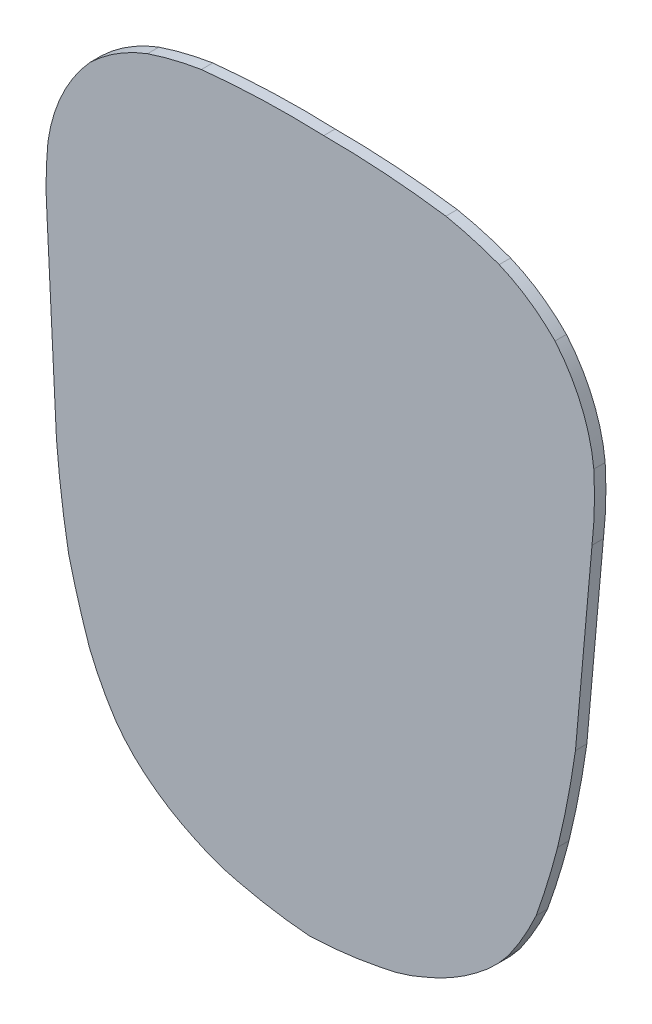
ISO-10303-21;
HEADER;
FILE_DESCRIPTION(('STEP AP214'),'2;1');
FILE_NAME('part.step','',(''),(''),'','','');
FILE_SCHEMA(('AUTOMOTIVE_DESIGN { 1 0 10303 214 1 1 1 1 }'));
ENDSEC;
DATA;
#1=APPLICATION_CONTEXT('core data for automotive mechanical design processes');
#2=APPLICATION_PROTOCOL_DEFINITION('international standard','automotive_design',2000,#1);
#3=PRODUCT_CONTEXT('',#1,'mechanical');
#4=PRODUCT('Part','Part','',(#3));
#5=PRODUCT_RELATED_PRODUCT_CATEGORY('part','',(#4));
#6=PRODUCT_DEFINITION_FORMATION('','',#4);
#7=PRODUCT_DEFINITION_CONTEXT('part definition',#1,'design');
#8=PRODUCT_DEFINITION('design','',#6,#7);
#9=PRODUCT_DEFINITION_SHAPE('','',#8);
#10=(LENGTH_UNIT() NAMED_UNIT(*) SI_UNIT(.MILLI.,.METRE.));
#11=(NAMED_UNIT(*) PLANE_ANGLE_UNIT() SI_UNIT($,.RADIAN.));
#12=(NAMED_UNIT(*) SI_UNIT($,.STERADIAN.) SOLID_ANGLE_UNIT());
#13=UNCERTAINTY_MEASURE_WITH_UNIT(LENGTH_MEASURE(1.E-05),#10,'distance_accuracy_value','');
#14=(GEOMETRIC_REPRESENTATION_CONTEXT(3) GLOBAL_UNCERTAINTY_ASSIGNED_CONTEXT((#13)) GLOBAL_UNIT_ASSIGNED_CONTEXT((#10,
#11,#12)) REPRESENTATION_CONTEXT('',''));
#15=CARTESIAN_POINT('',(0.,0.,0.));
#16=DIRECTION('',(0.,0.,1.));
#17=DIRECTION('',(1.,0.,0.));
#18=AXIS2_PLACEMENT_3D('',#15,#16,#17);
#19=CARTESIAN_POINT('',(-2.87645068487024,-22.2307778413904,40.6500965279302));
#20=DIRECTION('',(0.,0.,1.));
#21=DIRECTION('',(0.0193548335692301,0.999812677663925,0.));
#22=AXIS2_PLACEMENT_3D('',#19,#20,#21);
#23=PLANE('',#22);
#24=CARTESIAN_POINT('',(3.40605421210535,8.02001484887186,40.65009652793));
#25=DIRECTION('',(0.,0.,-1.));
#26=DIRECTION('',(-0.0193548335692301,-0.999812677663925,0.));
#27=AXIS2_PLACEMENT_3D('',#24,#25,#26);
#28=CIRCLE('',#27,7.43643173112);
#29=CARTESIAN_POINT('',(8.74976189327235,13.1916011731872,40.6500965279301));
#30=VERTEX_POINT('',#29);
#31=CARTESIAN_POINT('',(6.29473617833661,14.8724621043842,40.6500965279299));
#32=VERTEX_POINT('',#31);
#33=EDGE_CURVE('E400',#30,#32,#28,.F.);
#34=ORIENTED_EDGE('',*,*,#33,.F.);
#35=CARTESIAN_POINT('',(3.11803650286184,8.4313045354857,40.6500965279299));
#36=DIRECTION('',(0.,0.,-1.));
#37=DIRECTION('',(-0.0193548335692301,-0.999812677663925,0.));
#38=AXIS2_PLACEMENT_3D('',#35,#36,#37);
#39=CIRCLE('',#38,7.3740595978);
#40=CARTESIAN_POINT('',(10.4553019723893,9.16702892789537,40.6500965279302));
#41=VERTEX_POINT('',#40);
#42=EDGE_CURVE('E194',#41,#30,#39,.F.);
#43=ORIENTED_EDGE('',*,*,#42,.F.);
#44=CARTESIAN_POINT('',(-6.32552371849103,8.14421174061839,40.6500965279296));
#45=DIRECTION('',(0.,0.,-1.));
#46=DIRECTION('',(-0.0193548335692301,-0.999812677663925,0.));
#47=AXIS2_PLACEMENT_3D('',#44,#45,#46);
#48=CIRCLE('',#47,16.81196793556);
#49=CARTESIAN_POINT('',(10.3766044314372,6.22557130278915,40.6500965279302));
#50=VERTEX_POINT('',#49);
#51=EDGE_CURVE('E20',#50,#41,#48,.F.);
#52=ORIENTED_EDGE('',*,*,#51,.F.);
#53=DIRECTION('',(-0.0886995040357044,-0.996058431008854,0.));
#54=VECTOR('',#53,1.);
#55=CARTESIAN_POINT('',(10.3766044314372,6.22557130278917,40.6500965279302));
#56=LINE('',#55,#54);
#57=CARTESIAN_POINT('',(9.64811099468473,-1.9551061147509,40.6500965279303));
#58=VERTEX_POINT('',#57);
#59=EDGE_CURVE('E193',#50,#58,#56,.T.);
#60=ORIENTED_EDGE('',*,*,#59,.T.);
#61=CARTESIAN_POINT('',(-31.2814474166912,3.8013435473197,40.6500965279289));
#62=DIRECTION('',(0.,0.,-1.));
#63=DIRECTION('',(-0.0193548335692301,-0.999812677663925,0.));
#64=AXIS2_PLACEMENT_3D('',#61,#62,#63);
#65=CIRCLE('',#64,41.33237791928);
#66=CARTESIAN_POINT('',(8.86403234955439,-6.03257321052164,40.6500965279303));
#67=VERTEX_POINT('',#66);
#68=EDGE_CURVE('E206',#67,#58,#65,.F.);
#69=ORIENTED_EDGE('',*,*,#68,.F.);
#70=CARTESIAN_POINT('',(-24.9737606237931,2.68335405814092,40.6500965279291));
#71=DIRECTION('',(0.,0.,-1.));
#72=DIRECTION('',(-0.0193548335692301,-0.999812677663925,0.));
#73=AXIS2_PLACEMENT_3D('',#70,#71,#72);
#74=CIRCLE('',#73,34.94228987144);
#75=CARTESIAN_POINT('',(7.91947678147978,-9.10641075970414,40.6500965279303));
#76=VERTEX_POINT('',#75);
#77=EDGE_CURVE('E320',#76,#67,#74,.F.);
#78=ORIENTED_EDGE('',*,*,#77,.F.);
#79=CARTESIAN_POINT('',(-3.58067037627307,-3.93497982202901,40.6500965279299));
#80=DIRECTION('',(0.,0.,-1.));
#81=DIRECTION('',(-0.0193548335692301,-0.999812677663925,0.));
#82=AXIS2_PLACEMENT_3D('',#79,#80,#81);
#83=CIRCLE('',#82,12.60940452968);
#84=CARTESIAN_POINT('',(6.69776683055141,-11.2391437836663,40.6500965279303));
#85=VERTEX_POINT('',#84);
#86=EDGE_CURVE('E324',#85,#76,#83,.F.);
#87=ORIENTED_EDGE('',*,*,#86,.F.);
#88=CARTESIAN_POINT('',(1.10266886694135,-6.86934474010805,40.6500965279301));
#89=DIRECTION('',(0.,0.,-1.));
#90=DIRECTION('',(-0.0193548335692301,-0.999812677663925,0.));
#91=AXIS2_PLACEMENT_3D('',#88,#89,#90);
#92=CIRCLE('',#91,7.09931439672);
#93=CARTESIAN_POINT('',(5.30083998115858,-12.5943446701716,40.6500965279303));
#94=VERTEX_POINT('',#93);
#95=EDGE_CURVE('E328',#94,#85,#92,.F.);
#96=ORIENTED_EDGE('',*,*,#95,.F.);
#97=CARTESIAN_POINT('',(-0.638723059391889,-4.83953730632285,40.65009652793));
#98=DIRECTION('',(0.,0.,-1.));
#99=DIRECTION('',(-0.0193548335692301,-0.999812677663925,0.));
#100=AXIS2_PLACEMENT_3D('',#97,#98,#99);
#101=CIRCLE('',#100,9.76808304444);
#102=CARTESIAN_POINT('',(3.02325465351674,-13.8952187049387,40.6500965279303));
#103=VERTEX_POINT('',#102);
#104=EDGE_CURVE('E332',#103,#94,#101,.F.);
#105=ORIENTED_EDGE('',*,*,#104,.F.);
#106=CARTESIAN_POINT('',(-0.207770559998184,-6.83732878190935,40.6500965279301));
#107=DIRECTION('',(0.,0.,-1.));
#108=DIRECTION('',(-0.0193548335692301,-0.999812677663925,0.));
#109=AXIS2_PLACEMENT_3D('',#106,#107,#108);
#110=CIRCLE('',#109,7.76230211316);
#111=CARTESIAN_POINT('',(1.11765382111102,-14.4856347581324,40.6500965279302));
#112=VERTEX_POINT('',#111);
#113=EDGE_CURVE('E336',#112,#103,#110,.F.);
#114=ORIENTED_EDGE('',*,*,#113,.F.);
#115=CARTESIAN_POINT('',(-2.80966912930594,4.7550090968341,40.6500965279298));
#116=DIRECTION('',(0.,0.,-1.));
#117=DIRECTION('',(-0.0193548335692301,-0.999812677663925,0.));
#118=AXIS2_PLACEMENT_3D('',#115,#116,#117);
#119=CIRCLE('',#118,19.6373684976);
#120=CARTESIAN_POINT('',(-2.01526832310912,-14.8662846645275,40.6500965279301));
#121=VERTEX_POINT('',#120);
#122=EDGE_CURVE('E340',#121,#112,#119,.F.);
#123=ORIENTED_EDGE('',*,*,#122,.F.);
#124=CARTESIAN_POINT('',(-0.523207579480618,4.71400533480678,40.6500965279299));
#125=DIRECTION('',(0.,0.,-1.));
#126=DIRECTION('',(-0.0193548335692301,-0.999812677663925,0.));
#127=AXIS2_PLACEMENT_3D('',#124,#125,#126);
#128=CIRCLE('',#127,19.63705684976);
#129=CARTESIAN_POINT('',(-5.1763378218956,-14.3637927736708,40.65009652793));
#130=VERTEX_POINT('',#129);
#131=EDGE_CURVE('E344',#130,#121,#128,.F.);
#132=ORIENTED_EDGE('',*,*,#131,.F.);
#133=CARTESIAN_POINT('',(-3.55589855490557,-6.7725141805769,40.6500965279299));
#134=DIRECTION('',(0.,0.,-1.));
#135=DIRECTION('',(-0.0193548335692301,-0.999812677663925,0.));
#136=AXIS2_PLACEMENT_3D('',#133,#134,#135);
#137=CIRCLE('',#136,7.76230211316);
#138=CARTESIAN_POINT('',(-7.05766041396085,-13.7000677154429,40.6500965279299));
#139=VERTEX_POINT('',#138);
#140=EDGE_CURVE('E348',#139,#130,#137,.F.);
#141=ORIENTED_EDGE('',*,*,#140,.F.);
#142=CARTESIAN_POINT('',(-3.04794957670775,-4.79289839153915,40.6500965279299));
#143=DIRECTION('',(0.,0.,-1.));
#144=DIRECTION('',(-0.0193548335692301,-0.999812677663925,0.));
#145=AXIS2_PLACEMENT_3D('',#142,#143,#144);
#146=CIRCLE('',#145,9.76808304444);
#147=CARTESIAN_POINT('',(-9.28319236302833,-12.3120202657152,40.6500965279298));
#148=VERTEX_POINT('',#147);
#149=EDGE_CURVE('E352',#148,#139,#146,.F.);
#150=ORIENTED_EDGE('',*,*,#149,.F.);
#151=CARTESIAN_POINT('',(-4.76167465689594,-6.8387997753086,40.6500965279299));
#152=DIRECTION('',(0.,0.,-1.));
#153=DIRECTION('',(-0.0193548335692301,-0.999812677663925,0.));
#154=AXIS2_PLACEMENT_3D('',#151,#152,#153);
#155=CIRCLE('',#154,7.09931439672);
#156=CARTESIAN_POINT('',(-10.5813963887554,-10.9046457963967,40.6500965279298));
#157=VERTEX_POINT('',#156);
#158=EDGE_CURVE('E356',#157,#148,#155,.F.);
#159=ORIENTED_EDGE('',*,*,#158,.F.);
#160=CARTESIAN_POINT('',(-0.0279711922389195,-4.00375460651083,40.65009652793));
#161=DIRECTION('',(0.,0.,-1.));
#162=DIRECTION('',(-0.0193548335692301,-0.999812677663925,0.));
#163=AXIS2_PLACEMENT_3D('',#160,#161,#162);
#164=CIRCLE('',#163,12.60940452968);
#165=CARTESIAN_POINT('',(-11.719649090564,-8.72622753019504,40.6500965279297));
#166=VERTEX_POINT('',#165);
#167=EDGE_CURVE('E360',#166,#157,#164,.F.);
#168=ORIENTED_EDGE('',*,*,#167,.F.);
#169=CARTESIAN_POINT('',(21.3074102324666,2.68328490166432,40.6500965279306));
#170=DIRECTION('',(0.,0.,-1.));
#171=DIRECTION('',(-0.0193548335692301,-0.999812677663925,0.));
#172=AXIS2_PLACEMENT_3D('',#169,#170,#171);
#173=CIRCLE('',#172,34.94228987144);
#174=CARTESIAN_POINT('',(-12.6348799299237,-5.61638738053111,40.6500965279296));
#175=VERTEX_POINT('',#174);
#176=EDGE_CURVE('E364',#175,#166,#173,.F.);
#177=ORIENTED_EDGE('',*,*,#176,.F.);
#178=CARTESIAN_POINT('',(28.0310735031443,1.77588533100576,40.6500965279308));
#179=DIRECTION('',(0.,0.,-1.));
#180=DIRECTION('',(-0.0193548335692301,-0.999812677663925,0.));
#181=AXIS2_PLACEMENT_3D('',#178,#179,#180);
#182=CIRCLE('',#181,41.33237791928);
#183=CARTESIAN_POINT('',(-13.1702154109103,-1.51337845938617,40.6500965279295));
#184=VERTEX_POINT('',#183);
#185=EDGE_CURVE('E368',#184,#175,#182,.F.);
#186=ORIENTED_EDGE('',*,*,#185,.F.);
#187=DIRECTION('',(-0.0500831809567766,0.998745050042928,0.));
#188=VECTOR('',#187,1.);
#189=CARTESIAN_POINT('',(-13.1702154109104,-1.51337845938577,40.6500965279295));
#190=LINE('',#189,#188);
#191=CARTESIAN_POINT('',(-13.581551066226,6.6893642938588,40.6500965279294));
#192=VERTEX_POINT('',#191);
#193=EDGE_CURVE('E219',#184,#192,#190,.T.);
#194=ORIENTED_EDGE('',*,*,#193,.T.);
#195=CARTESIAN_POINT('',(3.18231954948573,7.96015453853931,40.6500965279299));
#196=DIRECTION('',(0.,0.,-1.));
#197=DIRECTION('',(-0.0193548335692301,-0.999812677663925,0.));
#198=AXIS2_PLACEMENT_3D('',#195,#196,#197);
#199=CIRCLE('',#198,16.81196793556);
#200=CARTESIAN_POINT('',(-13.5463481289566,9.63166390750373,40.6500965279294));
#201=VERTEX_POINT('',#200);
#202=EDGE_CURVE('E223',#201,#192,#199,.F.);
#203=ORIENTED_EDGE('',*,*,#202,.F.);
#204=CARTESIAN_POINT('',(-6.24305419079949,8.61252083374831,40.6500965279296));
#205=DIRECTION('',(0.,0.,-1.));
#206=DIRECTION('',(-0.0193548335692301,-0.999812677663925,0.));
#207=AXIS2_PLACEMENT_3D('',#204,#205,#206);
#208=CIRCLE('',#207,7.3740595978);
#209=CARTESIAN_POINT('',(-11.6863252040827,13.5872123445716,40.6500965279294));
#210=VERTEX_POINT('',#209);
#211=EDGE_CURVE('E376',#210,#201,#208,.F.);
#212=ORIENTED_EDGE('',*,*,#211,.F.);
#213=CARTESIAN_POINT('',(-6.54677401618397,8.21268627443506,40.6500965279296));
#214=DIRECTION('',(0.,0.,-1.));
#215=DIRECTION('',(-0.0193548335692301,-0.999812677663925,0.));
#216=AXIS2_PLACEMENT_3D('',#213,#214,#215);
#217=CIRCLE('',#216,7.43643173112);
#218=CARTESIAN_POINT('',(-9.16808546254466,15.17179851615,40.6500965279295));
#219=VERTEX_POINT('',#218);
#220=EDGE_CURVE('E380',#219,#210,#217,.F.);
#221=ORIENTED_EDGE('',*,*,#220,.F.);
#222=CARTESIAN_POINT('',(-4.43670572158516,1.02428534892834,40.6500965279298));
#223=DIRECTION('',(0.,0.,-1.));
#224=DIRECTION('',(-0.0193548335692301,-0.999812677663925,0.));
#225=AXIS2_PLACEMENT_3D('',#222,#223,#224);
#226=CIRCLE('',#225,14.91771038296);
#227=CARTESIAN_POINT('',(-6.80003650135277,15.7536013783737,40.6500965279295));
#228=VERTEX_POINT('',#227);
#229=EDGE_CURVE('E384',#228,#219,#226,.F.);
#230=ORIENTED_EDGE('',*,*,#229,.F.);
#231=CARTESIAN_POINT('',(-2.87645068487024,-22.2307778413904,40.6500965279302));
#232=DIRECTION('',(0.,0.,-1.));
#233=DIRECTION('',(-0.0193548335692301,-0.999812677663925,0.));
#234=AXIS2_PLACEMENT_3D('',#231,#232,#233);
#235=CIRCLE('',#234,38.18648439396);
#236=CARTESIAN_POINT('',(-1.41914055333817,15.9278887698879,40.6500965279297));
#237=VERTEX_POINT('',#236);
#238=EDGE_CURVE('E388',#237,#228,#235,.F.);
#239=ORIENTED_EDGE('',*,*,#238,.F.);
#240=CARTESIAN_POINT('',(-1.43975485684213,-22.2585901013477,40.6500965279302));
#241=DIRECTION('',(0.,0.,-1.));
#242=DIRECTION('',(-0.0193548335692301,-0.999812677663925,0.));
#243=AXIS2_PLACEMENT_3D('',#240,#241,#242);
#244=CIRCLE('',#243,38.186484435371);
#245=CARTESIAN_POINT('',(3.95097858118653,15.5454782846468,40.6500965279299));
#246=VERTEX_POINT('',#245);
#247=EDGE_CURVE('E392',#246,#237,#244,.F.);
#248=ORIENTED_EDGE('',*,*,#247,.F.);
#249=CARTESIAN_POINT('',(1.01935833845508,0.91866435193131,40.65009652793));
#250=DIRECTION('',(0.,0.,-1.));
#251=DIRECTION('',(-0.0193548335692301,-0.999812677663925,0.));
#252=AXIS2_PLACEMENT_3D('',#249,#250,#251);
#253=CIRCLE('',#252,14.91771038296);
#254=EDGE_CURVE('E396',#32,#246,#253,.F.);
#255=ORIENTED_EDGE('',*,*,#254,.F.);
#256=EDGE_LOOP('',(#34,#43,#52,#60,#69,#78,#87,#96,#105,#114,#123,#132,#141,#150,#159,#168,#177,
#186,#194,#203,#212,#221,#230,#239,#248,#255));
#257=FACE_BOUND('',#256,.T.);
#258=ADVANCED_FACE('F17',(#257),#23,.F.);
#259=CARTESIAN_POINT('',(-6.32552371849104,8.1442117406184,41.0310965279296));
#260=DIRECTION('',(0.,0.,-1.));
#261=DIRECTION('',(-0.0193548335692301,-0.999812677663925,0.));
#262=AXIS2_PLACEMENT_3D('',#259,#260,#261);
#263=CYLINDRICAL_SURFACE('',#262,16.81196793556);
#264=DIRECTION('',(0.,0.,-1.));
#265=VECTOR('',#264,1.);
#266=CARTESIAN_POINT('',(10.4553019723893,9.16702892789542,41.0310965279302));
#267=LINE('',#266,#265);
#268=CARTESIAN_POINT('',(10.4553019723893,9.1670289278954,41.1510965279302));
#269=VERTEX_POINT('',#268);
#270=EDGE_CURVE('E198',#269,#41,#267,.T.);
#271=ORIENTED_EDGE('',*,*,#270,.F.);
#272=CARTESIAN_POINT('',(-6.32552371849105,8.1442117406184,41.1510965279296));
#273=DIRECTION('',(0.,0.,-1.));
#274=DIRECTION('',(-0.0193548335692301,-0.999812677663925,0.));
#275=AXIS2_PLACEMENT_3D('',#272,#273,#274);
#276=CIRCLE('',#275,16.81196793556);
#277=CARTESIAN_POINT('',(10.3766044314372,6.22557130278928,41.1510965279302));
#278=VERTEX_POINT('',#277);
#279=EDGE_CURVE('E203',#278,#269,#276,.F.);
#280=ORIENTED_EDGE('',*,*,#279,.F.);
#281=DIRECTION('',(0.,0.,1.));
#282=VECTOR('',#281,1.);
#283=CARTESIAN_POINT('',(10.3766044314372,6.22557130278919,41.0310965279302));
#284=LINE('',#283,#282);
#285=EDGE_CURVE('E200',#278,#50,#284,.F.);
#286=ORIENTED_EDGE('',*,*,#285,.T.);
#287=ORIENTED_EDGE('',*,*,#51,.T.);
#288=EDGE_LOOP('',(#271,#280,#286,#287));
#289=FACE_BOUND('',#288,.T.);
#290=ADVANCED_FACE('F201',(#289),#263,.T.);
#291=CARTESIAN_POINT('',(3.11803650286183,8.43130453548571,41.0310965279299));
#292=DIRECTION('',(0.,0.,-1.));
#293=DIRECTION('',(-0.0193548335692301,-0.999812677663925,0.));
#294=AXIS2_PLACEMENT_3D('',#291,#292,#293);
#295=CYLINDRICAL_SURFACE('',#294,7.3740595978);
#296=DIRECTION('',(0.,0.,-1.));
#297=VECTOR('',#296,1.);
#298=CARTESIAN_POINT('',(8.74976189327234,13.1916011731872,41.03109652793));
#299=LINE('',#298,#297);
#300=CARTESIAN_POINT('',(8.74976189327234,13.1916011731872,41.15109652793));
#301=VERTEX_POINT('',#300);
#302=EDGE_CURVE('E402',#301,#30,#299,.T.);
#303=ORIENTED_EDGE('',*,*,#302,.F.);
#304=CARTESIAN_POINT('',(3.11803650286183,8.43130453548571,41.1510965279299));
#305=DIRECTION('',(0.,0.,-1.));
#306=DIRECTION('',(-0.0193548335692301,-0.999812677663925,0.));
#307=AXIS2_PLACEMENT_3D('',#304,#305,#306);
#308=CIRCLE('',#307,7.3740595978);
#309=EDGE_CURVE('E311',#269,#301,#308,.F.);
#310=ORIENTED_EDGE('',*,*,#309,.F.);
#311=ORIENTED_EDGE('',*,*,#270,.T.);
#312=ORIENTED_EDGE('',*,*,#42,.T.);
#313=EDGE_LOOP('',(#303,#310,#311,#312));
#314=FACE_BOUND('',#313,.T.);
#315=ADVANCED_FACE('F410',(#314),#295,.T.);
#316=CARTESIAN_POINT('',(3.40605421210534,8.02001484887187,41.03109652793));
#317=DIRECTION('',(0.,0.,-1.));
#318=DIRECTION('',(-0.0193548335692301,-0.999812677663925,0.));
#319=AXIS2_PLACEMENT_3D('',#316,#317,#318);
#320=CYLINDRICAL_SURFACE('',#319,7.43643173112);
#321=DIRECTION('',(0.,0.,-1.));
#322=VECTOR('',#321,1.);
#323=CARTESIAN_POINT('',(6.2947361783366,14.8724621043842,41.0310965279299));
#324=LINE('',#323,#322);
#325=CARTESIAN_POINT('',(6.29473617833659,14.8724621043842,41.1510965279299));
#326=VERTEX_POINT('',#325);
#327=EDGE_CURVE('E399',#326,#32,#324,.T.);
#328=ORIENTED_EDGE('',*,*,#327,.F.);
#329=CARTESIAN_POINT('',(3.40605421210533,8.02001484887187,41.15109652793));
#330=DIRECTION('',(0.,0.,-1.));
#331=DIRECTION('',(-0.0193548335692301,-0.999812677663925,0.));
#332=AXIS2_PLACEMENT_3D('',#329,#330,#331);
#333=CIRCLE('',#332,7.43643173112);
#334=EDGE_CURVE('E307',#301,#326,#333,.F.);
#335=ORIENTED_EDGE('',*,*,#334,.F.);
#336=ORIENTED_EDGE('',*,*,#302,.T.);
#337=ORIENTED_EDGE('',*,*,#33,.T.);
#338=EDGE_LOOP('',(#328,#335,#336,#337));
#339=FACE_BOUND('',#338,.T.);
#340=ADVANCED_FACE('F486',(#339),#320,.T.);
#341=CARTESIAN_POINT('',(1.01935833845507,0.918664351931317,41.03109652793));
#342=DIRECTION('',(0.,0.,-1.));
#343=DIRECTION('',(-0.0193548335692301,-0.999812677663925,0.));
#344=AXIS2_PLACEMENT_3D('',#341,#342,#343);
#345=CYLINDRICAL_SURFACE('',#344,14.91771038296);
#346=DIRECTION('',(0.,0.,-1.));
#347=VECTOR('',#346,1.);
#348=CARTESIAN_POINT('',(3.95097858118655,15.5454782846468,41.0310965279299));
#349=LINE('',#348,#347);
#350=CARTESIAN_POINT('',(3.95097858118653,15.5454782846468,41.1510965279299));
#351=VERTEX_POINT('',#350);
#352=EDGE_CURVE('E395',#351,#246,#349,.T.);
#353=ORIENTED_EDGE('',*,*,#352,.F.);
#354=CARTESIAN_POINT('',(1.01935833845506,0.918664351931319,41.15109652793));
#355=DIRECTION('',(0.,0.,-1.));
#356=DIRECTION('',(-0.0193548335692301,-0.999812677663925,0.));
#357=AXIS2_PLACEMENT_3D('',#354,#355,#356);
#358=CIRCLE('',#357,14.91771038296);
#359=EDGE_CURVE('E303',#326,#351,#358,.F.);
#360=ORIENTED_EDGE('',*,*,#359,.F.);
#361=ORIENTED_EDGE('',*,*,#327,.T.);
#362=ORIENTED_EDGE('',*,*,#254,.T.);
#363=EDGE_LOOP('',(#353,#360,#361,#362));
#364=FACE_BOUND('',#363,.T.);
#365=ADVANCED_FACE('F482',(#364),#345,.T.);
#366=CARTESIAN_POINT('',(-1.43975485684214,-22.2585901013477,41.0310965279302));
#367=DIRECTION('',(0.,0.,-1.));
#368=DIRECTION('',(-0.0193548335692301,-0.999812677663925,0.));
#369=AXIS2_PLACEMENT_3D('',#366,#367,#368);
#370=CYLINDRICAL_SURFACE('',#369,38.186484435371);
#371=DIRECTION('',(0.,0.,-1.));
#372=VECTOR('',#371,1.);
#373=CARTESIAN_POINT('',(-1.41914055333808,15.9278887698879,41.0310965279297));
#374=LINE('',#373,#372);
#375=CARTESIAN_POINT('',(-1.41914055333819,15.9278887698879,41.1510965279297));
#376=VERTEX_POINT('',#375);
#377=EDGE_CURVE('E391',#376,#237,#374,.T.);
#378=ORIENTED_EDGE('',*,*,#377,.F.);
#379=CARTESIAN_POINT('',(-1.43975485684214,-22.2585901013477,41.1510965279302));
#380=DIRECTION('',(0.,0.,-1.));
#381=DIRECTION('',(-0.0193548335692301,-0.999812677663925,0.));
#382=AXIS2_PLACEMENT_3D('',#379,#380,#381);
#383=CIRCLE('',#382,38.186484435371);
#384=EDGE_CURVE('E299',#351,#376,#383,.F.);
#385=ORIENTED_EDGE('',*,*,#384,.F.);
#386=ORIENTED_EDGE('',*,*,#352,.T.);
#387=ORIENTED_EDGE('',*,*,#247,.T.);
#388=EDGE_LOOP('',(#378,#385,#386,#387));
#389=FACE_BOUND('',#388,.T.);
#390=ADVANCED_FACE('F491',(#389),#370,.T.);
#391=CARTESIAN_POINT('',(-2.87645068487026,-22.2307778413904,41.0310965279302));
#392=DIRECTION('',(0.,0.,-1.));
#393=DIRECTION('',(-0.0193548335692301,-0.999812677663925,0.));
#394=AXIS2_PLACEMENT_3D('',#391,#392,#393);
#395=CYLINDRICAL_SURFACE('',#394,38.18648439396);
#396=DIRECTION('',(0.,0.,-1.));
#397=VECTOR('',#396,1.);
#398=CARTESIAN_POINT('',(-6.80003650135279,15.7536013783737,41.0310965279295));
#399=LINE('',#398,#397);
#400=CARTESIAN_POINT('',(-6.80003650135281,15.7536013783737,41.1510965279295));
#401=VERTEX_POINT('',#400);
#402=EDGE_CURVE('E387',#401,#228,#399,.T.);
#403=ORIENTED_EDGE('',*,*,#402,.F.);
#404=CARTESIAN_POINT('',(-2.87645068487026,-22.2307778413904,41.1510965279302));
#405=DIRECTION('',(0.,0.,-1.));
#406=DIRECTION('',(-0.0193548335692301,-0.999812677663925,0.));
#407=AXIS2_PLACEMENT_3D('',#404,#405,#406);
#408=CIRCLE('',#407,38.18648439396);
#409=EDGE_CURVE('E295',#376,#401,#408,.F.);
#410=ORIENTED_EDGE('',*,*,#409,.F.);
#411=ORIENTED_EDGE('',*,*,#377,.T.);
#412=ORIENTED_EDGE('',*,*,#238,.T.);
#413=EDGE_LOOP('',(#403,#410,#411,#412));
#414=FACE_BOUND('',#413,.T.);
#415=ADVANCED_FACE('F495',(#414),#395,.T.);
#416=CARTESIAN_POINT('',(-4.43670572158517,1.02428534892834,41.0310965279298));
#417=DIRECTION('',(0.,0.,-1.));
#418=DIRECTION('',(-0.0193548335692301,-0.999812677663925,0.));
#419=AXIS2_PLACEMENT_3D('',#416,#417,#418);
#420=CYLINDRICAL_SURFACE('',#419,14.91771038296);
#421=DIRECTION('',(0.,0.,-1.));
#422=VECTOR('',#421,1.);
#423=CARTESIAN_POINT('',(-9.16808546254464,15.17179851615,41.0310965279295));
#424=LINE('',#423,#422);
#425=CARTESIAN_POINT('',(-9.16808546254467,15.17179851615,41.1510965279294));
#426=VERTEX_POINT('',#425);
#427=EDGE_CURVE('E383',#426,#219,#424,.T.);
#428=ORIENTED_EDGE('',*,*,#427,.F.);
#429=CARTESIAN_POINT('',(-4.43670572158517,1.02428534892834,41.1510965279298));
#430=DIRECTION('',(0.,0.,-1.));
#431=DIRECTION('',(-0.0193548335692301,-0.999812677663925,0.));
#432=AXIS2_PLACEMENT_3D('',#429,#430,#431);
#433=CIRCLE('',#432,14.91771038296);
#434=EDGE_CURVE('E291',#401,#426,#433,.F.);
#435=ORIENTED_EDGE('',*,*,#434,.F.);
#436=ORIENTED_EDGE('',*,*,#402,.T.);
#437=ORIENTED_EDGE('',*,*,#229,.T.);
#438=EDGE_LOOP('',(#428,#435,#436,#437));
#439=FACE_BOUND('',#438,.T.);
#440=ADVANCED_FACE('F497',(#439),#420,.T.);
#441=CARTESIAN_POINT('',(-6.54677401618398,8.21268627443507,41.0310965279296));
#442=DIRECTION('',(0.,0.,-1.));
#443=DIRECTION('',(-0.0193548335692301,-0.999812677663925,0.));
#444=AXIS2_PLACEMENT_3D('',#441,#442,#443);
#445=CYLINDRICAL_SURFACE('',#444,7.43643173112);
#446=DIRECTION('',(0.,0.,-1.));
#447=VECTOR('',#446,1.);
#448=CARTESIAN_POINT('',(-11.6863252040827,13.5872123445716,41.0310965279294));
#449=LINE('',#448,#447);
#450=CARTESIAN_POINT('',(-11.6863252040827,13.5872123445716,41.1510965279294));
#451=VERTEX_POINT('',#450);
#452=EDGE_CURVE('E379',#451,#210,#449,.T.);
#453=ORIENTED_EDGE('',*,*,#452,.F.);
#454=CARTESIAN_POINT('',(-6.54677401618398,8.21268627443507,41.1510965279296));
#455=DIRECTION('',(0.,0.,-1.));
#456=DIRECTION('',(-0.0193548335692301,-0.999812677663925,0.));
#457=AXIS2_PLACEMENT_3D('',#454,#455,#456);
#458=CIRCLE('',#457,7.43643173112);
#459=EDGE_CURVE('E287',#426,#451,#458,.F.);
#460=ORIENTED_EDGE('',*,*,#459,.F.);
#461=ORIENTED_EDGE('',*,*,#427,.T.);
#462=ORIENTED_EDGE('',*,*,#220,.T.);
#463=EDGE_LOOP('',(#453,#460,#461,#462));
#464=FACE_BOUND('',#463,.T.);
#465=ADVANCED_FACE('F501',(#464),#445,.T.);
#466=CARTESIAN_POINT('',(-6.24305419079951,8.61252083374832,41.0310965279296));
#467=DIRECTION('',(0.,0.,-1.));
#468=DIRECTION('',(-0.0193548335692301,-0.999812677663925,0.));
#469=AXIS2_PLACEMENT_3D('',#466,#467,#468);
#470=CYLINDRICAL_SURFACE('',#469,7.3740595978);
#471=DIRECTION('',(0.,0.,-1.));
#472=VECTOR('',#471,1.);
#473=CARTESIAN_POINT('',(-13.5463481289566,9.63166390750374,41.0310965279294));
#474=LINE('',#473,#472);
#475=CARTESIAN_POINT('',(-13.5463481289566,9.63166390750374,41.1510965279294));
#476=VERTEX_POINT('',#475);
#477=EDGE_CURVE('E375',#476,#201,#474,.T.);
#478=ORIENTED_EDGE('',*,*,#477,.F.);
#479=CARTESIAN_POINT('',(-6.24305419079951,8.61252083374832,41.1510965279296));
#480=DIRECTION('',(0.,0.,-1.));
#481=DIRECTION('',(-0.0193548335692301,-0.999812677663925,0.));
#482=AXIS2_PLACEMENT_3D('',#479,#480,#481);
#483=CIRCLE('',#482,7.3740595978);
#484=EDGE_CURVE('E283',#451,#476,#483,.F.);
#485=ORIENTED_EDGE('',*,*,#484,.F.);
#486=ORIENTED_EDGE('',*,*,#452,.T.);
#487=ORIENTED_EDGE('',*,*,#211,.T.);
#488=EDGE_LOOP('',(#478,#485,#486,#487));
#489=FACE_BOUND('',#488,.T.);
#490=ADVANCED_FACE('F506',(#489),#470,.T.);
#491=CARTESIAN_POINT('',(3.18231954948572,7.96015453853931,41.0310965279299));
#492=DIRECTION('',(0.,0.,-1.));
#493=DIRECTION('',(-0.0193548335692301,-0.999812677663925,0.));
#494=AXIS2_PLACEMENT_3D('',#491,#492,#493);
#495=CYLINDRICAL_SURFACE('',#494,16.81196793556);
#496=DIRECTION('',(0.,0.,1.));
#497=VECTOR('',#496,1.);
#498=CARTESIAN_POINT('',(-13.581551066226,6.68936429385883,41.0310965279294));
#499=LINE('',#498,#497);
#500=CARTESIAN_POINT('',(-13.581551066226,6.68936429385881,41.1510965279294));
#501=VERTEX_POINT('',#500);
#502=EDGE_CURVE('E222',#192,#501,#499,.T.);
#503=ORIENTED_EDGE('',*,*,#502,.T.);
#504=CARTESIAN_POINT('',(3.18231954948571,7.96015453853931,41.1510965279299));
#505=DIRECTION('',(0.,0.,-1.));
#506=DIRECTION('',(-0.0193548335692301,-0.999812677663925,0.));
#507=AXIS2_PLACEMENT_3D('',#504,#505,#506);
#508=CIRCLE('',#507,16.81196793556);
#509=EDGE_CURVE('E279',#476,#501,#508,.F.);
#510=ORIENTED_EDGE('',*,*,#509,.F.);
#511=ORIENTED_EDGE('',*,*,#477,.T.);
#512=ORIENTED_EDGE('',*,*,#202,.T.);
#513=EDGE_LOOP('',(#503,#510,#511,#512));
#514=FACE_BOUND('',#513,.T.);
#515=ADVANCED_FACE('F510',(#514),#495,.T.);
#516=CARTESIAN_POINT('',(-13.1702154109104,-1.51337845938577,41.0310965279295));
#517=DIRECTION('',(0.998745050042928,0.0500831809567766,0.));
#518=DIRECTION('',(-0.0500831809567766,0.998745050042928,0.));
#519=AXIS2_PLACEMENT_3D('',#516,#517,#518);
#520=PLANE('',#519);
#521=ORIENTED_EDGE('',*,*,#502,.F.);
#522=ORIENTED_EDGE('',*,*,#193,.F.);
#523=DIRECTION('',(0.,0.,-1.));
#524=VECTOR('',#523,1.);
#525=CARTESIAN_POINT('',(-13.1702154109104,-1.51337845938598,41.0310965279295));
#526=LINE('',#525,#524);
#527=CARTESIAN_POINT('',(-13.1702154109104,-1.51337845938603,41.1510965279295));
#528=VERTEX_POINT('',#527);
#529=EDGE_CURVE('E371',#528,#184,#526,.T.);
#530=ORIENTED_EDGE('',*,*,#529,.F.);
#531=DIRECTION('',(0.050083180956776,-0.998745050042928,0.));
#532=VECTOR('',#531,1.);
#533=CARTESIAN_POINT('',(-13.581551066226,6.68936429385877,41.1510965279294));
#534=LINE('',#533,#532);
#535=EDGE_CURVE('E278',#501,#528,#534,.T.);
#536=ORIENTED_EDGE('',*,*,#535,.F.);
#537=EDGE_LOOP('',(#521,#522,#530,#536));
#538=FACE_BOUND('',#537,.T.);
#539=ADVANCED_FACE('F514',(#538),#520,.F.);
#540=CARTESIAN_POINT('',(28.0310735031443,1.77588533100576,41.0310965279308));
#541=DIRECTION('',(0.,0.,-1.));
#542=DIRECTION('',(-0.0193548335692301,-0.999812677663925,0.));
#543=AXIS2_PLACEMENT_3D('',#540,#541,#542);
#544=CYLINDRICAL_SURFACE('',#543,41.33237791928);
#545=DIRECTION('',(0.,0.,-1.));
#546=VECTOR('',#545,1.);
#547=CARTESIAN_POINT('',(-12.6348799299237,-5.61638738053119,41.0310965279296));
#548=LINE('',#547,#546);
#549=CARTESIAN_POINT('',(-12.6348799299237,-5.6163873805311,41.1510965279296));
#550=VERTEX_POINT('',#549);
#551=EDGE_CURVE('E367',#550,#175,#548,.T.);
#552=ORIENTED_EDGE('',*,*,#551,.F.);
#553=CARTESIAN_POINT('',(28.0310735031443,1.77588533100576,41.1510965279308));
#554=DIRECTION('',(0.,0.,-1.));
#555=DIRECTION('',(-0.0193548335692301,-0.999812677663925,0.));
#556=AXIS2_PLACEMENT_3D('',#553,#554,#555);
#557=CIRCLE('',#556,41.33237791928);
#558=EDGE_CURVE('E274',#528,#550,#557,.F.);
#559=ORIENTED_EDGE('',*,*,#558,.F.);
#560=ORIENTED_EDGE('',*,*,#529,.T.);
#561=ORIENTED_EDGE('',*,*,#185,.T.);
#562=EDGE_LOOP('',(#552,#559,#560,#561));
#563=FACE_BOUND('',#562,.T.);
#564=ADVANCED_FACE('F522',(#563),#544,.T.);
#565=CARTESIAN_POINT('',(21.3074102324666,2.68328490166432,41.0310965279306));
#566=DIRECTION('',(0.,0.,-1.));
#567=DIRECTION('',(-0.0193548335692301,-0.999812677663925,0.));
#568=AXIS2_PLACEMENT_3D('',#565,#566,#567);
#569=CYLINDRICAL_SURFACE('',#568,34.94228987144);
#570=DIRECTION('',(0.,0.,-1.));
#571=VECTOR('',#570,1.);
#572=CARTESIAN_POINT('',(-11.7196490905641,-8.72622753019499,41.0310965279297));
#573=LINE('',#572,#571);
#574=CARTESIAN_POINT('',(-11.7196490905641,-8.726227530195,41.1510965279297));
#575=VERTEX_POINT('',#574);
#576=EDGE_CURVE('E363',#575,#166,#573,.T.);
#577=ORIENTED_EDGE('',*,*,#576,.F.);
#578=CARTESIAN_POINT('',(21.3074102324666,2.68328490166432,41.1510965279305));
#579=DIRECTION('',(0.,0.,-1.));
#580=DIRECTION('',(-0.0193548335692301,-0.999812677663925,0.));
#581=AXIS2_PLACEMENT_3D('',#578,#579,#580);
#582=CIRCLE('',#581,34.94228987144);
#583=EDGE_CURVE('E270',#550,#575,#582,.F.);
#584=ORIENTED_EDGE('',*,*,#583,.F.);
#585=ORIENTED_EDGE('',*,*,#551,.T.);
#586=ORIENTED_EDGE('',*,*,#176,.T.);
#587=EDGE_LOOP('',(#577,#584,#585,#586));
#588=FACE_BOUND('',#587,.T.);
#589=ADVANCED_FACE('F526',(#588),#569,.T.);
#590=CARTESIAN_POINT('',(-0.0279711922389317,-4.00375460651083,41.03109652793));
#591=DIRECTION('',(0.,0.,-1.));
#592=DIRECTION('',(-0.0193548335692301,-0.999812677663925,0.));
#593=AXIS2_PLACEMENT_3D('',#590,#591,#592);
#594=CYLINDRICAL_SURFACE('',#593,12.60940452968);
#595=DIRECTION('',(0.,0.,-1.));
#596=VECTOR('',#595,1.);
#597=CARTESIAN_POINT('',(-10.5813963887555,-10.9046457963967,41.0310965279298));
#598=LINE('',#597,#596);
#599=CARTESIAN_POINT('',(-10.5813963887554,-10.9046457963967,41.1510965279297));
#600=VERTEX_POINT('',#599);
#601=EDGE_CURVE('E359',#600,#157,#598,.T.);
#602=ORIENTED_EDGE('',*,*,#601,.F.);
#603=CARTESIAN_POINT('',(-0.0279711922389356,-4.00375460651083,41.15109652793));
#604=DIRECTION('',(0.,0.,-1.));
#605=DIRECTION('',(-0.0193548335692301,-0.999812677663925,0.));
#606=AXIS2_PLACEMENT_3D('',#603,#604,#605);
#607=CIRCLE('',#606,12.60940452968);
#608=EDGE_CURVE('E266',#575,#600,#607,.F.);
#609=ORIENTED_EDGE('',*,*,#608,.F.);
#610=ORIENTED_EDGE('',*,*,#576,.T.);
#611=ORIENTED_EDGE('',*,*,#167,.T.);
#612=EDGE_LOOP('',(#602,#609,#610,#611));
#613=FACE_BOUND('',#612,.T.);
#614=ADVANCED_FACE('F530',(#613),#594,.T.);
#615=CARTESIAN_POINT('',(-4.76167465689596,-6.83879977530859,41.0310965279299));
#616=DIRECTION('',(0.,0.,-1.));
#617=DIRECTION('',(-0.0193548335692301,-0.999812677663925,0.));
#618=AXIS2_PLACEMENT_3D('',#615,#616,#617);
#619=CYLINDRICAL_SURFACE('',#618,7.09931439672);
#620=DIRECTION('',(0.,0.,-1.));
#621=VECTOR('',#620,1.);
#622=CARTESIAN_POINT('',(-9.28319236302901,-12.3120202657147,41.0310965279298));
#623=LINE('',#622,#621);
#624=CARTESIAN_POINT('',(-9.28319236302829,-12.3120202657153,41.1510965279298));
#625=VERTEX_POINT('',#624);
#626=EDGE_CURVE('E355',#625,#148,#623,.T.);
#627=ORIENTED_EDGE('',*,*,#626,.F.);
#628=CARTESIAN_POINT('',(-4.76167465689596,-6.83879977530859,41.1510965279299));
#629=DIRECTION('',(0.,0.,-1.));
#630=DIRECTION('',(-0.0193548335692301,-0.999812677663925,0.));
#631=AXIS2_PLACEMENT_3D('',#628,#629,#630);
#632=CIRCLE('',#631,7.09931439672);
#633=EDGE_CURVE('E263',#600,#625,#632,.F.);
#634=ORIENTED_EDGE('',*,*,#633,.F.);
#635=ORIENTED_EDGE('',*,*,#601,.T.);
#636=ORIENTED_EDGE('',*,*,#158,.T.);
#637=EDGE_LOOP('',(#627,#634,#635,#636));
#638=FACE_BOUND('',#637,.T.);
#639=ADVANCED_FACE('F534',(#638),#619,.T.);
#640=CARTESIAN_POINT('',(-3.04794957670776,-4.79289839153915,41.0310965279299));
#641=DIRECTION('',(0.,0.,-1.));
#642=DIRECTION('',(-0.0193548335692301,-0.999812677663925,0.));
#643=AXIS2_PLACEMENT_3D('',#640,#641,#642);
#644=CYLINDRICAL_SURFACE('',#643,9.76808304444);
#645=DIRECTION('',(0.,0.,-1.));
#646=VECTOR('',#645,1.);
#647=CARTESIAN_POINT('',(-7.05766041396086,-13.7000677154429,41.0310965279299));
#648=LINE('',#647,#646);
#649=CARTESIAN_POINT('',(-7.05766041396087,-13.7000677154429,41.1510965279299));
#650=VERTEX_POINT('',#649);
#651=EDGE_CURVE('E351',#650,#139,#648,.T.);
#652=ORIENTED_EDGE('',*,*,#651,.F.);
#653=CARTESIAN_POINT('',(-3.04794957670776,-4.79289839153915,41.1510965279299));
#654=DIRECTION('',(0.,0.,-1.));
#655=DIRECTION('',(-0.0193548335692301,-0.999812677663925,0.));
#656=AXIS2_PLACEMENT_3D('',#653,#654,#655);
#657=CIRCLE('',#656,9.76808304444);
#658=EDGE_CURVE('E259',#625,#650,#657,.F.);
#659=ORIENTED_EDGE('',*,*,#658,.F.);
#660=ORIENTED_EDGE('',*,*,#626,.T.);
#661=ORIENTED_EDGE('',*,*,#149,.T.);
#662=EDGE_LOOP('',(#652,#659,#660,#661));
#663=FACE_BOUND('',#662,.T.);
#664=ADVANCED_FACE('F538',(#663),#644,.T.);
#665=CARTESIAN_POINT('',(-3.55589855490558,-6.77251418057689,41.0310965279299));
#666=DIRECTION('',(0.,0.,-1.));
#667=DIRECTION('',(-0.0193548335692301,-0.999812677663925,0.));
#668=AXIS2_PLACEMENT_3D('',#665,#666,#667);
#669=CYLINDRICAL_SURFACE('',#668,7.76230211316);
#670=DIRECTION('',(0.,0.,-1.));
#671=VECTOR('',#670,1.);
#672=CARTESIAN_POINT('',(-5.17633782189558,-14.3637927736708,41.03109652793));
#673=LINE('',#672,#671);
#674=CARTESIAN_POINT('',(-5.17633782189556,-14.3637927736708,41.15109652793));
#675=VERTEX_POINT('',#674);
#676=EDGE_CURVE('E347',#675,#130,#673,.T.);
#677=ORIENTED_EDGE('',*,*,#676,.F.);
#678=CARTESIAN_POINT('',(-3.55589855490558,-6.77251418057689,41.1510965279299));
#679=DIRECTION('',(0.,0.,-1.));
#680=DIRECTION('',(-0.0193548335692301,-0.999812677663925,0.));
#681=AXIS2_PLACEMENT_3D('',#678,#679,#680);
#682=CIRCLE('',#681,7.76230211316);
#683=EDGE_CURVE('E255',#650,#675,#682,.F.);
#684=ORIENTED_EDGE('',*,*,#683,.F.);
#685=ORIENTED_EDGE('',*,*,#651,.T.);
#686=ORIENTED_EDGE('',*,*,#140,.T.);
#687=EDGE_LOOP('',(#677,#684,#685,#686));
#688=FACE_BOUND('',#687,.T.);
#689=ADVANCED_FACE('F542',(#688),#669,.T.);
#690=CARTESIAN_POINT('',(-0.523207579480631,4.71400533480679,41.0310965279299));
#691=DIRECTION('',(0.,0.,-1.));
#692=DIRECTION('',(-0.0193548335692301,-0.999812677663925,0.));
#693=AXIS2_PLACEMENT_3D('',#690,#691,#692);
#694=CYLINDRICAL_SURFACE('',#693,19.63705684976);
#695=DIRECTION('',(0.,0.,-1.));
#696=VECTOR('',#695,1.);
#697=CARTESIAN_POINT('',(-2.01526832310913,-14.8662846645275,41.0310965279301));
#698=LINE('',#697,#696);
#699=CARTESIAN_POINT('',(-2.01526832310914,-14.8662846645275,41.1510965279301));
#700=VERTEX_POINT('',#699);
#701=EDGE_CURVE('E343',#700,#121,#698,.T.);
#702=ORIENTED_EDGE('',*,*,#701,.F.);
#703=CARTESIAN_POINT('',(-0.523207579480634,4.71400533480679,41.1510965279299));
#704=DIRECTION('',(0.,0.,-1.));
#705=DIRECTION('',(-0.0193548335692301,-0.999812677663925,0.));
#706=AXIS2_PLACEMENT_3D('',#703,#704,#705);
#707=CIRCLE('',#706,19.63705684976);
#708=EDGE_CURVE('E251',#675,#700,#707,.F.);
#709=ORIENTED_EDGE('',*,*,#708,.F.);
#710=ORIENTED_EDGE('',*,*,#676,.T.);
#711=ORIENTED_EDGE('',*,*,#131,.T.);
#712=EDGE_LOOP('',(#702,#709,#710,#711));
#713=FACE_BOUND('',#712,.T.);
#714=ADVANCED_FACE('F546',(#713),#694,.T.);
#715=CARTESIAN_POINT('',(-2.80966912930595,4.75500909683411,41.0310965279298));
#716=DIRECTION('',(0.,0.,-1.));
#717=DIRECTION('',(-0.0193548335692301,-0.999812677663925,0.));
#718=AXIS2_PLACEMENT_3D('',#715,#716,#717);
#719=CYLINDRICAL_SURFACE('',#718,19.6373684976);
#720=DIRECTION('',(0.,0.,-1.));
#721=VECTOR('',#720,1.);
#722=CARTESIAN_POINT('',(1.11765382111103,-14.4856347581324,41.0310965279302));
#723=LINE('',#722,#721);
#724=CARTESIAN_POINT('',(1.11765382111102,-14.4856347581324,41.1510965279302));
#725=VERTEX_POINT('',#724);
#726=EDGE_CURVE('E339',#725,#112,#723,.T.);
#727=ORIENTED_EDGE('',*,*,#726,.F.);
#728=CARTESIAN_POINT('',(-2.80966912930596,4.75500909683411,41.1510965279298));
#729=DIRECTION('',(0.,0.,-1.));
#730=DIRECTION('',(-0.0193548335692301,-0.999812677663925,0.));
#731=AXIS2_PLACEMENT_3D('',#728,#729,#730);
#732=CIRCLE('',#731,19.6373684976);
#733=EDGE_CURVE('E247',#700,#725,#732,.F.);
#734=ORIENTED_EDGE('',*,*,#733,.F.);
#735=ORIENTED_EDGE('',*,*,#701,.T.);
#736=ORIENTED_EDGE('',*,*,#122,.T.);
#737=EDGE_LOOP('',(#727,#734,#735,#736));
#738=FACE_BOUND('',#737,.T.);
#739=ADVANCED_FACE('F550',(#738),#719,.T.);
#740=CARTESIAN_POINT('',(-0.207770559998196,-6.83732878190934,41.03109652793));
#741=DIRECTION('',(0.,0.,-1.));
#742=DIRECTION('',(-0.0193548335692301,-0.999812677663925,0.));
#743=AXIS2_PLACEMENT_3D('',#740,#741,#742);
#744=CYLINDRICAL_SURFACE('',#743,7.76230211316);
#745=DIRECTION('',(0.,0.,-1.));
#746=VECTOR('',#745,1.);
#747=CARTESIAN_POINT('',(3.02325465351674,-13.8952187049387,41.0310965279303));
#748=LINE('',#747,#746);
#749=CARTESIAN_POINT('',(3.02325465351673,-13.8952187049387,41.1510965279302));
#750=VERTEX_POINT('',#749);
#751=EDGE_CURVE('E335',#750,#103,#748,.T.);
#752=ORIENTED_EDGE('',*,*,#751,.F.);
#753=CARTESIAN_POINT('',(-0.207770559998199,-6.83732878190934,41.15109652793));
#754=DIRECTION('',(0.,0.,-1.));
#755=DIRECTION('',(-0.0193548335692301,-0.999812677663925,0.));
#756=AXIS2_PLACEMENT_3D('',#753,#754,#755);
#757=CIRCLE('',#756,7.76230211316);
#758=EDGE_CURVE('E243',#725,#750,#757,.F.);
#759=ORIENTED_EDGE('',*,*,#758,.F.);
#760=ORIENTED_EDGE('',*,*,#726,.T.);
#761=ORIENTED_EDGE('',*,*,#113,.T.);
#762=EDGE_LOOP('',(#752,#759,#760,#761));
#763=FACE_BOUND('',#762,.T.);
#764=ADVANCED_FACE('F554',(#763),#744,.T.);
#765=CARTESIAN_POINT('',(-0.638723059391901,-4.83953730632285,41.03109652793));
#766=DIRECTION('',(0.,0.,-1.));
#767=DIRECTION('',(-0.0193548335692301,-0.999812677663925,0.));
#768=AXIS2_PLACEMENT_3D('',#765,#766,#767);
#769=CYLINDRICAL_SURFACE('',#768,9.76808304444);
#770=DIRECTION('',(0.,0.,-1.));
#771=VECTOR('',#770,1.);
#772=CARTESIAN_POINT('',(5.30083998115854,-12.5943446701716,41.0310965279303));
#773=LINE('',#772,#771);
#774=CARTESIAN_POINT('',(5.30083998115857,-12.5943446701716,41.1510965279303));
#775=VERTEX_POINT('',#774);
#776=EDGE_CURVE('E331',#775,#94,#773,.T.);
#777=ORIENTED_EDGE('',*,*,#776,.F.);
#778=CARTESIAN_POINT('',(-0.638723059391905,-4.83953730632285,41.15109652793));
#779=DIRECTION('',(0.,0.,-1.));
#780=DIRECTION('',(-0.0193548335692301,-0.999812677663925,0.));
#781=AXIS2_PLACEMENT_3D('',#778,#779,#780);
#782=CIRCLE('',#781,9.76808304444);
#783=EDGE_CURVE('E239',#750,#775,#782,.F.);
#784=ORIENTED_EDGE('',*,*,#783,.F.);
#785=ORIENTED_EDGE('',*,*,#751,.T.);
#786=ORIENTED_EDGE('',*,*,#104,.T.);
#787=EDGE_LOOP('',(#777,#784,#785,#786));
#788=FACE_BOUND('',#787,.T.);
#789=ADVANCED_FACE('F558',(#788),#769,.T.);
#790=CARTESIAN_POINT('',(1.10266886694134,-6.86934474010805,41.0310965279301));
#791=DIRECTION('',(0.,0.,-1.));
#792=DIRECTION('',(-0.0193548335692301,-0.999812677663925,0.));
#793=AXIS2_PLACEMENT_3D('',#790,#791,#792);
#794=CYLINDRICAL_SURFACE('',#793,7.09931439672);
#795=DIRECTION('',(0.,0.,-1.));
#796=VECTOR('',#795,1.);
#797=CARTESIAN_POINT('',(6.69776683055139,-11.2391437836663,41.0310965279303));
#798=LINE('',#797,#796);
#799=CARTESIAN_POINT('',(6.6977668305514,-11.2391437836663,41.1510965279303));
#800=VERTEX_POINT('',#799);
#801=EDGE_CURVE('E327',#800,#85,#798,.T.);
#802=ORIENTED_EDGE('',*,*,#801,.F.);
#803=CARTESIAN_POINT('',(1.10266886694133,-6.86934474010804,41.15109652793));
#804=DIRECTION('',(0.,0.,-1.));
#805=DIRECTION('',(-0.0193548335692301,-0.999812677663925,0.));
#806=AXIS2_PLACEMENT_3D('',#803,#804,#805);
#807=CIRCLE('',#806,7.09931439672);
#808=EDGE_CURVE('E235',#775,#800,#807,.F.);
#809=ORIENTED_EDGE('',*,*,#808,.F.);
#810=ORIENTED_EDGE('',*,*,#776,.T.);
#811=ORIENTED_EDGE('',*,*,#95,.T.);
#812=EDGE_LOOP('',(#802,#809,#810,#811));
#813=FACE_BOUND('',#812,.T.);
#814=ADVANCED_FACE('F562',(#813),#794,.T.);
#815=CARTESIAN_POINT('',(-3.58067037627309,-3.93497982202901,41.0310965279299));
#816=DIRECTION('',(0.,0.,-1.));
#817=DIRECTION('',(-0.0193548335692301,-0.999812677663925,0.));
#818=AXIS2_PLACEMENT_3D('',#815,#816,#817);
#819=CYLINDRICAL_SURFACE('',#818,12.60940452968);
#820=DIRECTION('',(0.,0.,-1.));
#821=VECTOR('',#820,1.);
#822=CARTESIAN_POINT('',(7.91947678147978,-9.1064107597041,41.0310965279303));
#823=LINE('',#822,#821);
#824=CARTESIAN_POINT('',(7.91947678147978,-9.10641075970411,41.1510965279303));
#825=VERTEX_POINT('',#824);
#826=EDGE_CURVE('E323',#825,#76,#823,.T.);
#827=ORIENTED_EDGE('',*,*,#826,.F.);
#828=CARTESIAN_POINT('',(-3.58067037627309,-3.93497982202901,41.1510965279299));
#829=DIRECTION('',(0.,0.,-1.));
#830=DIRECTION('',(-0.0193548335692301,-0.999812677663925,0.));
#831=AXIS2_PLACEMENT_3D('',#828,#829,#830);
#832=CIRCLE('',#831,12.60940452968);
#833=EDGE_CURVE('E231',#800,#825,#832,.F.);
#834=ORIENTED_EDGE('',*,*,#833,.F.);
#835=ORIENTED_EDGE('',*,*,#801,.T.);
#836=ORIENTED_EDGE('',*,*,#86,.T.);
#837=EDGE_LOOP('',(#827,#834,#835,#836));
#838=FACE_BOUND('',#837,.T.);
#839=ADVANCED_FACE('F566',(#838),#819,.T.);
#840=CARTESIAN_POINT('',(-24.9737606237931,2.68335405814093,41.0310965279291));
#841=DIRECTION('',(0.,0.,-1.));
#842=DIRECTION('',(-0.0193548335692301,-0.999812677663925,0.));
#843=AXIS2_PLACEMENT_3D('',#840,#841,#842);
#844=CYLINDRICAL_SURFACE('',#843,34.94228987144);
#845=DIRECTION('',(0.,0.,-1.));
#846=VECTOR('',#845,1.);
#847=CARTESIAN_POINT('',(8.86403234955429,-6.032573210522,41.0310965279303));
#848=LINE('',#847,#846);
#849=CARTESIAN_POINT('',(8.86403234955436,-6.03257321052168,41.1510965279303));
#850=VERTEX_POINT('',#849);
#851=EDGE_CURVE('E319',#850,#67,#848,.T.);
#852=ORIENTED_EDGE('',*,*,#851,.F.);
#853=CARTESIAN_POINT('',(-24.9737606237931,2.68335405814093,41.1510965279291));
#854=DIRECTION('',(0.,0.,-1.));
#855=DIRECTION('',(-0.0193548335692301,-0.999812677663925,0.));
#856=AXIS2_PLACEMENT_3D('',#853,#854,#855);
#857=CIRCLE('',#856,34.94228987144);
#858=EDGE_CURVE('E227',#825,#850,#857,.F.);
#859=ORIENTED_EDGE('',*,*,#858,.F.);
#860=ORIENTED_EDGE('',*,*,#826,.T.);
#861=ORIENTED_EDGE('',*,*,#77,.T.);
#862=EDGE_LOOP('',(#852,#859,#860,#861));
#863=FACE_BOUND('',#862,.T.);
#864=ADVANCED_FACE('F568',(#863),#844,.T.);
#865=CARTESIAN_POINT('',(-31.2814474166912,3.80134354731971,41.0310965279289));
#866=DIRECTION('',(0.,0.,-1.));
#867=DIRECTION('',(-0.0193548335692301,-0.999812677663925,0.));
#868=AXIS2_PLACEMENT_3D('',#865,#866,#867);
#869=CYLINDRICAL_SURFACE('',#868,41.33237791928);
#870=DIRECTION('',(0.,0.,1.));
#871=VECTOR('',#870,1.);
#872=CARTESIAN_POINT('',(9.64811099468473,-1.95510611475075,41.0310965279303));
#873=LINE('',#872,#871);
#874=CARTESIAN_POINT('',(9.64811099468471,-1.9551061147509,41.1510965279302));
#875=VERTEX_POINT('',#874);
#876=EDGE_CURVE('E36',#58,#875,#873,.T.);
#877=ORIENTED_EDGE('',*,*,#876,.T.);
#878=CARTESIAN_POINT('',(-31.2814474166912,3.80134354731971,41.1510965279289));
#879=DIRECTION('',(0.,0.,-1.));
#880=DIRECTION('',(-0.0193548335692301,-0.999812677663925,0.));
#881=AXIS2_PLACEMENT_3D('',#878,#879,#880);
#882=CIRCLE('',#881,41.33237791928);
#883=EDGE_CURVE('E27',#850,#875,#882,.F.);
#884=ORIENTED_EDGE('',*,*,#883,.F.);
#885=ORIENTED_EDGE('',*,*,#851,.T.);
#886=ORIENTED_EDGE('',*,*,#68,.T.);
#887=EDGE_LOOP('',(#877,#884,#885,#886));
#888=FACE_BOUND('',#887,.T.);
#889=ADVANCED_FACE('F416',(#888),#869,.T.);
#890=CARTESIAN_POINT('',(10.3766044314372,6.22557130278918,41.0310965279302));
#891=DIRECTION('',(-0.996058431008854,0.0886995040357044,0.));
#892=DIRECTION('',(-0.0886995040357044,-0.996058431008854,0.));
#893=AXIS2_PLACEMENT_3D('',#890,#891,#892);
#894=PLANE('',#893);
#895=ORIENTED_EDGE('',*,*,#876,.F.);
#896=ORIENTED_EDGE('',*,*,#59,.F.);
#897=ORIENTED_EDGE('',*,*,#285,.F.);
#898=DIRECTION('',(0.088699504035705,0.996058431008854,0.));
#899=VECTOR('',#898,1.);
#900=CARTESIAN_POINT('',(9.64811099468472,-1.95510611475082,41.1510965279302));
#901=LINE('',#900,#899);
#902=EDGE_CURVE('E11',#875,#278,#901,.T.);
#903=ORIENTED_EDGE('',*,*,#902,.F.);
#904=EDGE_LOOP('',(#895,#896,#897,#903));
#905=FACE_BOUND('',#904,.T.);
#906=ADVANCED_FACE('F208',(#905),#894,.F.);
#907=CARTESIAN_POINT('',(3.40605421210533,8.02001484887187,41.15109652793));
#908=DIRECTION('',(0.,0.,1.));
#909=DIRECTION('',(0.0193548335692301,0.999812677663925,0.));
#910=AXIS2_PLACEMENT_3D('',#907,#908,#909);
#911=PLANE('',#910);
#912=ORIENTED_EDGE('',*,*,#883,.T.);
#913=ORIENTED_EDGE('',*,*,#902,.T.);
#914=ORIENTED_EDGE('',*,*,#279,.T.);
#915=ORIENTED_EDGE('',*,*,#309,.T.);
#916=ORIENTED_EDGE('',*,*,#334,.T.);
#917=ORIENTED_EDGE('',*,*,#359,.T.);
#918=ORIENTED_EDGE('',*,*,#384,.T.);
#919=ORIENTED_EDGE('',*,*,#409,.T.);
#920=ORIENTED_EDGE('',*,*,#434,.T.);
#921=ORIENTED_EDGE('',*,*,#459,.T.);
#922=ORIENTED_EDGE('',*,*,#484,.T.);
#923=ORIENTED_EDGE('',*,*,#509,.T.);
#924=ORIENTED_EDGE('',*,*,#535,.T.);
#925=ORIENTED_EDGE('',*,*,#558,.T.);
#926=ORIENTED_EDGE('',*,*,#583,.T.);
#927=ORIENTED_EDGE('',*,*,#608,.T.);
#928=ORIENTED_EDGE('',*,*,#633,.T.);
#929=ORIENTED_EDGE('',*,*,#658,.T.);
#930=ORIENTED_EDGE('',*,*,#683,.T.);
#931=ORIENTED_EDGE('',*,*,#708,.T.);
#932=ORIENTED_EDGE('',*,*,#733,.T.);
#933=ORIENTED_EDGE('',*,*,#758,.T.);
#934=ORIENTED_EDGE('',*,*,#783,.T.);
#935=ORIENTED_EDGE('',*,*,#808,.T.);
#936=ORIENTED_EDGE('',*,*,#833,.T.);
#937=ORIENTED_EDGE('',*,*,#858,.T.);
#938=EDGE_LOOP('',(#912,#913,#914,#915,#916,#917,#918,#919,#920,#921,#922,#923,#924,#925,#926,
#927,#928,#929,#930,#931,#932,#933,#934,#935,#936,#937));
#939=FACE_BOUND('',#938,.T.);
#940=ADVANCED_FACE('F413',(#939),#911,.T.);
#941=CLOSED_SHELL('',(#258,#290,#315,#340,#365,#390,#415,#440,#465,#490,#515,#539,#564,#589,
#614,#639,#664,#689,#714,#739,#764,#789,#814,#839,#864,#889,#906,#940));
#942=MANIFOLD_SOLID_BREP('B1',#941);
#943=ADVANCED_BREP_SHAPE_REPRESENTATION('',(#18,#942),#14);
#944=SHAPE_DEFINITION_REPRESENTATION(#9,#943);
ENDSEC;
END-ISO-10303-21;
